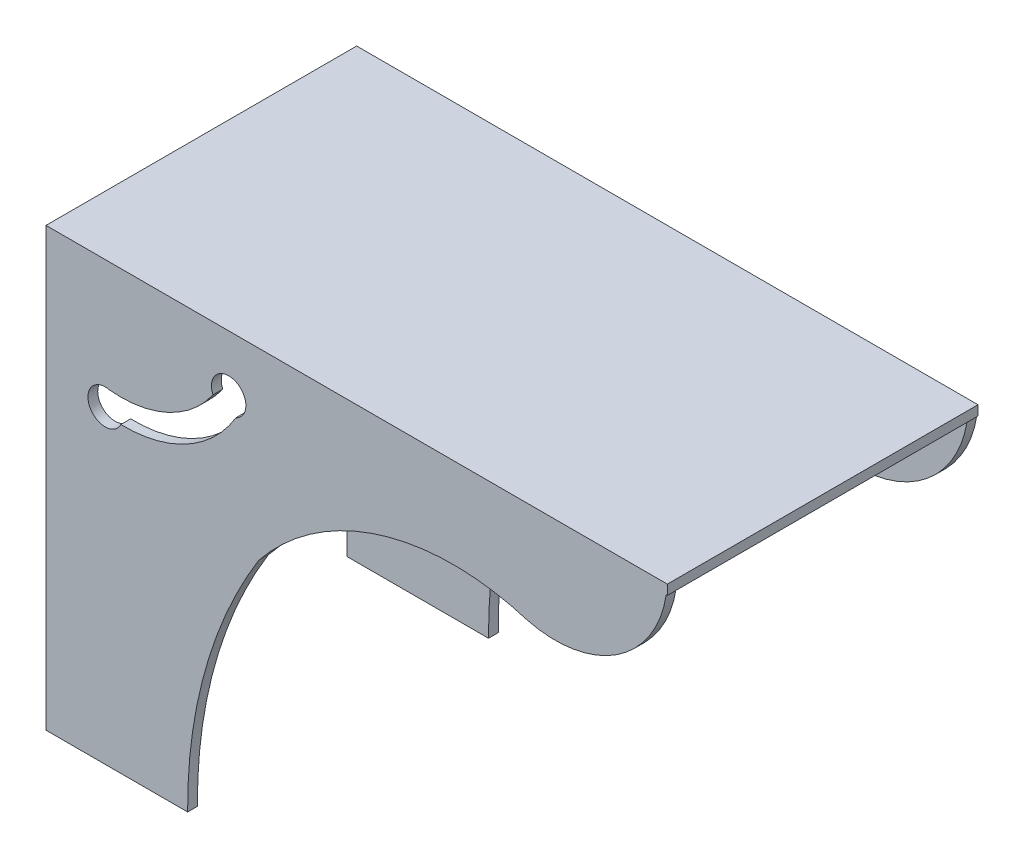
ISO-10303-21;
HEADER;
FILE_DESCRIPTION(('STEP AP214'),'2;1');
FILE_NAME('part.step','',(''),(''),'','','');
FILE_SCHEMA(('AUTOMOTIVE_DESIGN { 1 0 10303 214 1 1 1 1 }'));
ENDSEC;
DATA;
#1=APPLICATION_CONTEXT('core data for automotive mechanical design processes');
#2=APPLICATION_PROTOCOL_DEFINITION('international standard','automotive_design',2000,#1);
#3=PRODUCT_CONTEXT('',#1,'mechanical');
#4=PRODUCT('Part','Part','',(#3));
#5=PRODUCT_RELATED_PRODUCT_CATEGORY('part','',(#4));
#6=PRODUCT_DEFINITION_FORMATION('','',#4);
#7=PRODUCT_DEFINITION_CONTEXT('part definition',#1,'design');
#8=PRODUCT_DEFINITION('design','',#6,#7);
#9=PRODUCT_DEFINITION_SHAPE('','',#8);
#10=(LENGTH_UNIT() NAMED_UNIT(*) SI_UNIT(.MILLI.,.METRE.));
#11=(NAMED_UNIT(*) PLANE_ANGLE_UNIT() SI_UNIT($,.RADIAN.));
#12=(NAMED_UNIT(*) SI_UNIT($,.STERADIAN.) SOLID_ANGLE_UNIT());
#13=UNCERTAINTY_MEASURE_WITH_UNIT(LENGTH_MEASURE(1.E-05),#10,'distance_accuracy_value','');
#14=(GEOMETRIC_REPRESENTATION_CONTEXT(3) GLOBAL_UNCERTAINTY_ASSIGNED_CONTEXT((#13)) GLOBAL_UNIT_ASSIGNED_CONTEXT((#10,
#11,#12)) REPRESENTATION_CONTEXT('',''));
#15=CARTESIAN_POINT('',(0.,0.,0.));
#16=DIRECTION('',(0.,0.,1.));
#17=DIRECTION('',(1.,0.,0.));
#18=AXIS2_PLACEMENT_3D('',#15,#16,#17);
#19=CARTESIAN_POINT('',(0.,0.,0.));
#20=DIRECTION('',(0.,1.,0.));
#21=DIRECTION('',(0.,0.,1.));
#22=AXIS2_PLACEMENT_3D('',#19,#20,#21);
#23=PLANE('',#22);
#24=DIRECTION('',(1.,0.,0.));
#25=VECTOR('',#24,1.);
#26=CARTESIAN_POINT('',(0.,0.,14.875));
#27=LINE('',#26,#25);
#28=CARTESIAN_POINT('',(-31.75,0.,14.875));
#29=VERTEX_POINT('',#28);
#30=CARTESIAN_POINT('',(31.6379040167772,0.,14.875));
#31=VERTEX_POINT('',#30);
#32=EDGE_CURVE('E11',#29,#31,#27,.T.);
#33=ORIENTED_EDGE('',*,*,#32,.F.);
#34=DIRECTION('',(0.,0.,1.));
#35=VECTOR('',#34,1.);
#36=CARTESIAN_POINT('',(-31.75,0.,-15.875));
#37=LINE('',#36,#35);
#38=CARTESIAN_POINT('',(-31.75,0.,-14.875));
#39=VERTEX_POINT('',#38);
#40=EDGE_CURVE('E134',#39,#29,#37,.T.);
#41=ORIENTED_EDGE('',*,*,#40,.F.);
#42=DIRECTION('',(-1.,0.,0.));
#43=VECTOR('',#42,1.);
#44=CARTESIAN_POINT('',(0.,0.,-14.875));
#45=LINE('',#44,#43);
#46=CARTESIAN_POINT('',(31.6379040167772,0.,-14.875));
#47=VERTEX_POINT('',#46);
#48=EDGE_CURVE('E80',#47,#39,#45,.T.);
#49=ORIENTED_EDGE('',*,*,#48,.F.);
#50=DIRECTION('',(0.,0.,-1.));
#51=VECTOR('',#50,1.);
#52=CARTESIAN_POINT('',(31.6379040167772,0.,-14.875));
#53=LINE('',#52,#51);
#54=CARTESIAN_POINT('',(31.6379040167772,0.,-15.875));
#55=VERTEX_POINT('',#54);
#56=EDGE_CURVE('E150',#47,#55,#53,.T.);
#57=ORIENTED_EDGE('',*,*,#56,.T.);
#58=DIRECTION('',(-1.,0.,0.));
#59=VECTOR('',#58,1.);
#60=CARTESIAN_POINT('',(-31.75,0.,-15.875));
#61=LINE('',#60,#59);
#62=CARTESIAN_POINT('',(31.75,0.,-15.875));
#63=VERTEX_POINT('',#62);
#64=EDGE_CURVE('E69',#63,#55,#61,.T.);
#65=ORIENTED_EDGE('',*,*,#64,.F.);
#66=DIRECTION('',(0.,0.,-1.));
#67=VECTOR('',#66,1.);
#68=CARTESIAN_POINT('',(31.75,0.,-15.875));
#69=LINE('',#68,#67);
#70=CARTESIAN_POINT('',(31.75,0.,15.875));
#71=VERTEX_POINT('',#70);
#72=EDGE_CURVE('E127',#71,#63,#69,.T.);
#73=ORIENTED_EDGE('',*,*,#72,.F.);
#74=DIRECTION('',(1.,0.,0.));
#75=VECTOR('',#74,1.);
#76=CARTESIAN_POINT('',(-31.75,0.,15.875));
#77=LINE('',#76,#75);
#78=CARTESIAN_POINT('',(31.6379040167772,0.,15.875));
#79=VERTEX_POINT('',#78);
#80=EDGE_CURVE('E138',#79,#71,#77,.T.);
#81=ORIENTED_EDGE('',*,*,#80,.F.);
#82=DIRECTION('',(0.,0.,1.));
#83=VECTOR('',#82,1.);
#84=CARTESIAN_POINT('',(31.6379040167772,0.,14.875));
#85=LINE('',#84,#83);
#86=EDGE_CURVE('E49',#31,#79,#85,.T.);
#87=ORIENTED_EDGE('',*,*,#86,.F.);
#88=EDGE_LOOP('',(#33,#41,#49,#57,#65,#73,#81,#87));
#89=FACE_BOUND('',#88,.T.);
#90=ADVANCED_FACE('F39',(#89),#23,.F.);
#91=CARTESIAN_POINT('',(31.75,1.,-15.875));
#92=DIRECTION('',(-1.,0.,0.));
#93=DIRECTION('',(0.,0.,1.));
#94=AXIS2_PLACEMENT_3D('',#91,#92,#93);
#95=PLANE('',#94);
#96=ORIENTED_EDGE('',*,*,#72,.T.);
#97=DIRECTION('',(0.,-1.,0.));
#98=VECTOR('',#97,1.);
#99=CARTESIAN_POINT('',(31.75,1.,-15.875));
#100=LINE('',#99,#98);
#101=CARTESIAN_POINT('',(31.75,1.,-15.875));
#102=VERTEX_POINT('',#101);
#103=EDGE_CURVE('E114',#102,#63,#100,.T.);
#104=ORIENTED_EDGE('',*,*,#103,.F.);
#105=DIRECTION('',(0.,0.,-1.));
#106=VECTOR('',#105,1.);
#107=CARTESIAN_POINT('',(31.75,1.,-15.875));
#108=LINE('',#107,#106);
#109=CARTESIAN_POINT('',(31.75,1.,15.875));
#110=VERTEX_POINT('',#109);
#111=EDGE_CURVE('E96',#110,#102,#108,.T.);
#112=ORIENTED_EDGE('',*,*,#111,.F.);
#113=DIRECTION('',(0.,-1.,0.));
#114=VECTOR('',#113,1.);
#115=CARTESIAN_POINT('',(31.75,1.,15.875));
#116=LINE('',#115,#114);
#117=EDGE_CURVE('E123',#110,#71,#116,.T.);
#118=ORIENTED_EDGE('',*,*,#117,.T.);
#119=EDGE_LOOP('',(#96,#104,#112,#118));
#120=FACE_BOUND('',#119,.T.);
#121=ADVANCED_FACE('F41',(#120),#95,.F.);
#122=CARTESIAN_POINT('',(-31.75,1.,-15.875));
#123=DIRECTION('',(0.,0.,1.));
#124=DIRECTION('',(1.,0.,0.));
#125=AXIS2_PLACEMENT_3D('',#122,#123,#124);
#126=PLANE('',#125);
#127=ORIENTED_EDGE('',*,*,#64,.T.);
#128=CARTESIAN_POINT('',(20.2915948472761,1.77815843703277,-15.875));
#129=DIRECTION('',(0.,0.,-1.));
#130=DIRECTION('',(-1.,0.,0.));
#131=AXIS2_PLACEMENT_3D('',#128,#129,#130);
#132=CIRCLE('',#131,11.4847977429772);
#133=CARTESIAN_POINT('',(17.4534216794093,-9.35042423401278,-15.875));
#134=VERTEX_POINT('',#133);
#135=EDGE_CURVE('E256',#55,#134,#132,.T.);
#136=ORIENTED_EDGE('',*,*,#135,.T.);
#137=CARTESIAN_POINT('',(9.89769197929239,-33.6929893961255,-15.875));
#138=DIRECTION('',(0.,0.,1.));
#139=DIRECTION('',(1.,0.,0.));
#140=AXIS2_PLACEMENT_3D('',#137,#138,#139);
#141=CIRCLE('',#140,25.4882233585029);
#142=CARTESIAN_POINT('',(-10.0200966304964,-17.7891776873338,-15.875));
#143=VERTEX_POINT('',#142);
#144=EDGE_CURVE('E291',#134,#143,#141,.T.);
#145=ORIENTED_EDGE('',*,*,#144,.T.);
#146=CARTESIAN_POINT('',(31.1951491813184,-43.2989287250127,-15.875));
#147=DIRECTION('',(0.,0.,1.));
#148=DIRECTION('',(1.,0.,0.));
#149=AXIS2_PLACEMENT_3D('',#146,#147,#148);
#150=CIRCLE('',#149,48.4710623499493);
#151=CARTESIAN_POINT('',(-17.2743956937058,-43.6824713441464,-15.875));
#152=VERTEX_POINT('',#151);
#153=EDGE_CURVE('E295',#143,#152,#150,.T.);
#154=ORIENTED_EDGE('',*,*,#153,.T.);
#155=DIRECTION('',(-1.,0.,0.));
#156=VECTOR('',#155,1.);
#157=CARTESIAN_POINT('',(-17.2743956937058,-43.6824713441464,-15.875));
#158=LINE('',#157,#156);
#159=CARTESIAN_POINT('',(-31.75,-43.6824713441464,-15.875));
#160=VERTEX_POINT('',#159);
#161=EDGE_CURVE('E109',#152,#160,#158,.T.);
#162=ORIENTED_EDGE('',*,*,#161,.T.);
#163=DIRECTION('',(0.,-1.,0.));
#164=VECTOR('',#163,1.);
#165=CARTESIAN_POINT('',(-31.75,1.,-15.875));
#166=LINE('',#165,#164);
#167=CARTESIAN_POINT('',(-31.75,1.,-15.875));
#168=VERTEX_POINT('',#167);
#169=EDGE_CURVE('E103',#168,#160,#166,.T.);
#170=ORIENTED_EDGE('',*,*,#169,.F.);
#171=DIRECTION('',(-1.,0.,0.));
#172=VECTOR('',#171,1.);
#173=CARTESIAN_POINT('',(-31.75,1.,-15.875));
#174=LINE('',#173,#172);
#175=EDGE_CURVE('E89',#102,#168,#174,.T.);
#176=ORIENTED_EDGE('',*,*,#175,.F.);
#177=ORIENTED_EDGE('',*,*,#103,.T.);
#178=EDGE_LOOP('',(#127,#136,#145,#154,#162,#170,#176,#177));
#179=FACE_BOUND('',#178,.T.);
#180=CARTESIAN_POINT('',(-13.0812509604539,-4.7342310141083,-15.875));
#181=DIRECTION('',(0.,0.,-1.));
#182=DIRECTION('',(-1.,0.,0.));
#183=AXIS2_PLACEMENT_3D('',#180,#181,#182);
#184=CIRCLE('',#183,1.75850942259397);
#185=CARTESIAN_POINT('',(-14.6821723220576,-5.46183405376155,-15.875));
#186=VERTEX_POINT('',#185);
#187=CARTESIAN_POINT('',(-12.3536479208006,-6.33515237571203,-15.875));
#188=VERTEX_POINT('',#187);
#189=EDGE_CURVE('E236',#186,#188,#184,.T.);
#190=ORIENTED_EDGE('',*,*,#189,.F.);
#191=CARTESIAN_POINT('',(-24.0968511259508,1.0851600643245,-15.875));
#192=DIRECTION('',(0.,0.,1.));
#193=DIRECTION('',(-1.,0.,0.));
#194=AXIS2_PLACEMENT_3D('',#191,#192,#193);
#195=CIRCLE('',#194,11.4673148104833);
#196=CARTESIAN_POINT('',(-25.2846256929615,-10.3204745318166,-15.875));
#197=VERTEX_POINT('',#196);
#198=EDGE_CURVE('E223',#197,#186,#195,.T.);
#199=ORIENTED_EDGE('',*,*,#198,.F.);
#200=CARTESIAN_POINT('',(-25.6949217020572,-12.0405759818048,-15.875));
#201=DIRECTION('',(0.,0.,-1.));
#202=DIRECTION('',(1.,0.,0.));
#203=AXIS2_PLACEMENT_3D('',#200,#201,#202);
#204=CIRCLE('',#203,1.76835850814573);
#205=CARTESIAN_POINT('',(-24.0968511259508,-12.7977168188451,-15.875));
#206=VERTEX_POINT('',#205);
#207=EDGE_CURVE('E245',#206,#197,#204,.T.);
#208=ORIENTED_EDGE('',*,*,#207,.F.);
#209=CARTESIAN_POINT('',(-23.7461456214285,0.465651786454748,-15.875));
#210=DIRECTION('',(0.,0.,-1.));
#211=DIRECTION('',(-1.,0.,0.));
#212=AXIS2_PLACEMENT_3D('',#209,#210,#211);
#213=CIRCLE('',#212,13.2680044132852);
#214=EDGE_CURVE('E240',#188,#206,#213,.T.);
#215=ORIENTED_EDGE('',*,*,#214,.F.);
#216=EDGE_LOOP('',(#190,#199,#208,#215));
#217=FACE_BOUND('',#216,.T.);
#218=ADVANCED_FACE('F104',(#179,#217),#126,.F.);
#219=CARTESIAN_POINT('',(-31.75,1.,-15.875));
#220=DIRECTION('',(1.,0.,0.));
#221=DIRECTION('',(0.,0.,-1.));
#222=AXIS2_PLACEMENT_3D('',#219,#220,#221);
#223=PLANE('',#222);
#224=DIRECTION('',(0.,-1.,0.));
#225=VECTOR('',#224,1.);
#226=CARTESIAN_POINT('',(-31.75,1.,15.875));
#227=LINE('',#226,#225);
#228=CARTESIAN_POINT('',(-31.75,1.,15.875));
#229=VERTEX_POINT('',#228);
#230=CARTESIAN_POINT('',(-31.75,-43.6824713441464,15.875));
#231=VERTEX_POINT('',#230);
#232=EDGE_CURVE('E115',#229,#231,#227,.T.);
#233=ORIENTED_EDGE('',*,*,#232,.F.);
#234=DIRECTION('',(0.,0.,1.));
#235=VECTOR('',#234,1.);
#236=CARTESIAN_POINT('',(-31.75,1.,-15.875));
#237=LINE('',#236,#235);
#238=EDGE_CURVE('E93',#168,#229,#237,.T.);
#239=ORIENTED_EDGE('',*,*,#238,.F.);
#240=ORIENTED_EDGE('',*,*,#169,.T.);
#241=DIRECTION('',(0.,0.,-1.));
#242=VECTOR('',#241,1.);
#243=CARTESIAN_POINT('',(-31.75,-43.6824713441464,-14.875));
#244=LINE('',#243,#242);
#245=CARTESIAN_POINT('',(-31.75,-43.6824713441464,-14.875));
#246=VERTEX_POINT('',#245);
#247=EDGE_CURVE('E131',#246,#160,#244,.T.);
#248=ORIENTED_EDGE('',*,*,#247,.F.);
#249=DIRECTION('',(0.,1.,0.));
#250=VECTOR('',#249,1.);
#251=CARTESIAN_POINT('',(-31.75,-17.7891776873338,-14.875));
#252=LINE('',#251,#250);
#253=EDGE_CURVE('E284',#246,#39,#252,.T.);
#254=ORIENTED_EDGE('',*,*,#253,.T.);
#255=ORIENTED_EDGE('',*,*,#40,.T.);
#256=DIRECTION('',(0.,1.,0.));
#257=VECTOR('',#256,1.);
#258=CARTESIAN_POINT('',(-31.75,1.,14.875));
#259=LINE('',#258,#257);
#260=CARTESIAN_POINT('',(-31.75,-43.6824713441464,14.875));
#261=VERTEX_POINT('',#260);
#262=EDGE_CURVE('E204',#261,#29,#259,.T.);
#263=ORIENTED_EDGE('',*,*,#262,.F.);
#264=DIRECTION('',(0.,0.,1.));
#265=VECTOR('',#264,1.);
#266=CARTESIAN_POINT('',(-31.75,-43.6824713441464,14.875));
#267=LINE('',#266,#265);
#268=EDGE_CURVE('E196',#261,#231,#267,.T.);
#269=ORIENTED_EDGE('',*,*,#268,.T.);
#270=EDGE_LOOP('',(#233,#239,#240,#248,#254,#255,#263,#269));
#271=FACE_BOUND('',#270,.T.);
#272=ADVANCED_FACE('F117',(#271),#223,.F.);
#273=CARTESIAN_POINT('',(-31.75,1.,15.875));
#274=DIRECTION('',(0.,0.,-1.));
#275=DIRECTION('',(-1.,0.,0.));
#276=AXIS2_PLACEMENT_3D('',#273,#274,#275);
#277=PLANE('',#276);
#278=ORIENTED_EDGE('',*,*,#232,.T.);
#279=DIRECTION('',(-1.,0.,0.));
#280=VECTOR('',#279,1.);
#281=CARTESIAN_POINT('',(-17.2743956937058,-43.6824713441464,15.875));
#282=LINE('',#281,#280);
#283=CARTESIAN_POINT('',(-17.2743956937058,-43.6824713441464,15.875));
#284=VERTEX_POINT('',#283);
#285=EDGE_CURVE('E180',#284,#231,#282,.T.);
#286=ORIENTED_EDGE('',*,*,#285,.F.);
#287=CARTESIAN_POINT('',(31.1951491813184,-43.2989287250127,15.875));
#288=DIRECTION('',(0.,0.,1.));
#289=DIRECTION('',(1.,0.,0.));
#290=AXIS2_PLACEMENT_3D('',#287,#288,#289);
#291=CIRCLE('',#290,48.4710623499493);
#292=CARTESIAN_POINT('',(-10.0200966304964,-17.7891776873338,15.875));
#293=VERTEX_POINT('',#292);
#294=EDGE_CURVE('E200',#293,#284,#291,.T.);
#295=ORIENTED_EDGE('',*,*,#294,.F.);
#296=CARTESIAN_POINT('',(9.89769197929239,-33.6929893961255,15.875));
#297=DIRECTION('',(0.,0.,1.));
#298=DIRECTION('',(1.,0.,0.));
#299=AXIS2_PLACEMENT_3D('',#296,#297,#298);
#300=CIRCLE('',#299,25.4882233585029);
#301=CARTESIAN_POINT('',(17.4534216794093,-9.35042423401278,15.875));
#302=VERTEX_POINT('',#301);
#303=EDGE_CURVE('E177',#302,#293,#300,.T.);
#304=ORIENTED_EDGE('',*,*,#303,.F.);
#305=CARTESIAN_POINT('',(20.2915948472761,1.77815843703277,15.875));
#306=DIRECTION('',(0.,0.,-1.));
#307=DIRECTION('',(-1.,0.,0.));
#308=AXIS2_PLACEMENT_3D('',#305,#306,#307);
#309=CIRCLE('',#308,11.4847977429772);
#310=EDGE_CURVE('E163',#79,#302,#309,.T.);
#311=ORIENTED_EDGE('',*,*,#310,.F.);
#312=ORIENTED_EDGE('',*,*,#80,.T.);
#313=ORIENTED_EDGE('',*,*,#117,.F.);
#314=DIRECTION('',(1.,0.,0.));
#315=VECTOR('',#314,1.);
#316=CARTESIAN_POINT('',(-31.75,1.,15.875));
#317=LINE('',#316,#315);
#318=EDGE_CURVE('E57',#229,#110,#317,.T.);
#319=ORIENTED_EDGE('',*,*,#318,.F.);
#320=EDGE_LOOP('',(#278,#286,#295,#304,#311,#312,#313,#319));
#321=FACE_BOUND('',#320,.T.);
#322=CARTESIAN_POINT('',(-24.0968511259508,1.0851600643245,15.875));
#323=DIRECTION('',(0.,0.,1.));
#324=DIRECTION('',(-1.,0.,0.));
#325=AXIS2_PLACEMENT_3D('',#322,#323,#324);
#326=CIRCLE('',#325,11.4673148104833);
#327=CARTESIAN_POINT('',(-25.2846256929615,-10.3204745318166,15.875));
#328=VERTEX_POINT('',#327);
#329=CARTESIAN_POINT('',(-14.6821723220576,-5.46183405376155,15.875));
#330=VERTEX_POINT('',#329);
#331=EDGE_CURVE('E362',#328,#330,#326,.T.);
#332=ORIENTED_EDGE('',*,*,#331,.T.);
#333=CARTESIAN_POINT('',(-13.0812509604539,-4.7342310141083,15.875));
#334=DIRECTION('',(0.,0.,-1.));
#335=DIRECTION('',(-1.,0.,0.));
#336=AXIS2_PLACEMENT_3D('',#333,#334,#335);
#337=CIRCLE('',#336,1.75850942259397);
#338=CARTESIAN_POINT('',(-12.3536479208006,-6.33515237571202,15.875));
#339=VERTEX_POINT('',#338);
#340=EDGE_CURVE('E366',#330,#339,#337,.T.);
#341=ORIENTED_EDGE('',*,*,#340,.T.);
#342=CARTESIAN_POINT('',(-23.7461456214285,0.465651786454748,15.875));
#343=DIRECTION('',(0.,0.,-1.));
#344=DIRECTION('',(-1.,0.,0.));
#345=AXIS2_PLACEMENT_3D('',#342,#343,#344);
#346=CIRCLE('',#345,13.2680044132852);
#347=CARTESIAN_POINT('',(-24.0968511259508,-12.7977168188451,15.875));
#348=VERTEX_POINT('',#347);
#349=EDGE_CURVE('E353',#339,#348,#346,.T.);
#350=ORIENTED_EDGE('',*,*,#349,.T.);
#351=CARTESIAN_POINT('',(-25.6949217020572,-12.0405759818048,15.875));
#352=DIRECTION('',(0.,0.,-1.));
#353=DIRECTION('',(1.,0.,0.));
#354=AXIS2_PLACEMENT_3D('',#351,#352,#353);
#355=CIRCLE('',#354,1.76835850814573);
#356=EDGE_CURVE('E358',#348,#328,#355,.T.);
#357=ORIENTED_EDGE('',*,*,#356,.T.);
#358=EDGE_LOOP('',(#332,#341,#350,#357));
#359=FACE_BOUND('',#358,.T.);
#360=ADVANCED_FACE('F173',(#321,#359),#277,.F.);
#361=CARTESIAN_POINT('',(0.,1.,0.));
#362=DIRECTION('',(0.,1.,0.));
#363=DIRECTION('',(0.,0.,1.));
#364=AXIS2_PLACEMENT_3D('',#361,#362,#363);
#365=PLANE('',#364);
#366=ORIENTED_EDGE('',*,*,#111,.T.);
#367=ORIENTED_EDGE('',*,*,#175,.T.);
#368=ORIENTED_EDGE('',*,*,#238,.T.);
#369=ORIENTED_EDGE('',*,*,#318,.T.);
#370=EDGE_LOOP('',(#366,#367,#368,#369));
#371=FACE_BOUND('',#370,.T.);
#372=ADVANCED_FACE('F91',(#371),#365,.T.);
#373=CARTESIAN_POINT('',(20.2915948472761,1.77815843703277,-14.875));
#374=DIRECTION('',(0.,0.,-1.));
#375=DIRECTION('',(-1.,0.,0.));
#376=AXIS2_PLACEMENT_3D('',#373,#374,#375);
#377=CYLINDRICAL_SURFACE('',#376,11.4847977429772);
#378=ORIENTED_EDGE('',*,*,#56,.F.);
#379=CARTESIAN_POINT('',(20.2915948472761,1.77815843703277,-14.875));
#380=DIRECTION('',(0.,0.,-1.));
#381=DIRECTION('',(-1.,0.,0.));
#382=AXIS2_PLACEMENT_3D('',#379,#380,#381);
#383=CIRCLE('',#382,11.4847977429772);
#384=CARTESIAN_POINT('',(17.4534216794093,-9.35042423401278,-14.875));
#385=VERTEX_POINT('',#384);
#386=EDGE_CURVE('E268',#47,#385,#383,.T.);
#387=ORIENTED_EDGE('',*,*,#386,.T.);
#388=DIRECTION('',(0.,0.,-1.));
#389=VECTOR('',#388,1.);
#390=CARTESIAN_POINT('',(17.4534216794093,-9.35042423401278,-14.875));
#391=LINE('',#390,#389);
#392=EDGE_CURVE('E287',#385,#134,#391,.T.);
#393=ORIENTED_EDGE('',*,*,#392,.T.);
#394=ORIENTED_EDGE('',*,*,#135,.F.);
#395=EDGE_LOOP('',(#378,#387,#393,#394));
#396=FACE_BOUND('',#395,.T.);
#397=ADVANCED_FACE('F458',(#396),#377,.T.);
#398=CARTESIAN_POINT('',(20.2915948472761,1.77815843703277,-14.875));
#399=DIRECTION('',(0.,0.,-1.));
#400=DIRECTION('',(-1.,0.,0.));
#401=AXIS2_PLACEMENT_3D('',#398,#399,#400);
#402=PLANE('',#401);
#403=CARTESIAN_POINT('',(-24.0968511259508,1.0851600643245,-14.875));
#404=DIRECTION('',(0.,0.,1.));
#405=DIRECTION('',(-1.,0.,0.));
#406=AXIS2_PLACEMENT_3D('',#403,#404,#405);
#407=CIRCLE('',#406,11.4673148104833);
#408=CARTESIAN_POINT('',(-25.2846256929615,-10.3204745318166,-14.875));
#409=VERTEX_POINT('',#408);
#410=CARTESIAN_POINT('',(-14.6821723220576,-5.46183405376155,-14.875));
#411=VERTEX_POINT('',#410);
#412=EDGE_CURVE('E231',#409,#411,#407,.T.);
#413=ORIENTED_EDGE('',*,*,#412,.T.);
#414=CARTESIAN_POINT('',(-13.0812509604539,-4.7342310141083,-14.875));
#415=DIRECTION('',(0.,0.,-1.));
#416=DIRECTION('',(-1.,0.,0.));
#417=AXIS2_PLACEMENT_3D('',#414,#415,#416);
#418=CIRCLE('',#417,1.75850942259397);
#419=CARTESIAN_POINT('',(-12.3536479208006,-6.33515237571202,-14.875));
#420=VERTEX_POINT('',#419);
#421=EDGE_CURVE('E218',#411,#420,#418,.T.);
#422=ORIENTED_EDGE('',*,*,#421,.T.);
#423=CARTESIAN_POINT('',(-23.7461456214285,0.465651786454748,-14.875));
#424=DIRECTION('',(0.,0.,-1.));
#425=DIRECTION('',(-1.,0.,0.));
#426=AXIS2_PLACEMENT_3D('',#423,#424,#425);
#427=CIRCLE('',#426,13.2680044132852);
#428=CARTESIAN_POINT('',(-24.0968511259508,-12.7977168188451,-14.875));
#429=VERTEX_POINT('',#428);
#430=EDGE_CURVE('E222',#420,#429,#427,.T.);
#431=ORIENTED_EDGE('',*,*,#430,.T.);
#432=CARTESIAN_POINT('',(-25.6949217020572,-12.0405759818048,-14.875));
#433=DIRECTION('',(0.,0.,-1.));
#434=DIRECTION('',(1.,0.,0.));
#435=AXIS2_PLACEMENT_3D('',#432,#433,#434);
#436=CIRCLE('',#435,1.76835850814573);
#437=EDGE_CURVE('E227',#429,#409,#436,.T.);
#438=ORIENTED_EDGE('',*,*,#437,.T.);
#439=EDGE_LOOP('',(#413,#422,#431,#438));
#440=FACE_BOUND('',#439,.T.);
#441=ORIENTED_EDGE('',*,*,#386,.F.);
#442=ORIENTED_EDGE('',*,*,#48,.T.);
#443=ORIENTED_EDGE('',*,*,#253,.F.);
#444=DIRECTION('',(-1.,0.,0.));
#445=VECTOR('',#444,1.);
#446=CARTESIAN_POINT('',(-17.2743956937058,-43.6824713441464,-14.875));
#447=LINE('',#446,#445);
#448=CARTESIAN_POINT('',(-17.2743956937058,-43.6824713441464,-14.875));
#449=VERTEX_POINT('',#448);
#450=EDGE_CURVE('E280',#449,#246,#447,.T.);
#451=ORIENTED_EDGE('',*,*,#450,.F.);
#452=CARTESIAN_POINT('',(31.1951491813184,-43.2989287250127,-14.875));
#453=DIRECTION('',(0.,0.,1.));
#454=DIRECTION('',(1.,0.,0.));
#455=AXIS2_PLACEMENT_3D('',#452,#453,#454);
#456=CIRCLE('',#455,48.4710623499493);
#457=CARTESIAN_POINT('',(-10.0200966304964,-17.7891776873338,-14.875));
#458=VERTEX_POINT('',#457);
#459=EDGE_CURVE('E276',#458,#449,#456,.T.);
#460=ORIENTED_EDGE('',*,*,#459,.F.);
#461=CARTESIAN_POINT('',(9.89769197929239,-33.6929893961255,-14.875));
#462=DIRECTION('',(0.,0.,1.));
#463=DIRECTION('',(1.,0.,0.));
#464=AXIS2_PLACEMENT_3D('',#461,#462,#463);
#465=CIRCLE('',#464,25.4882233585029);
#466=EDGE_CURVE('E272',#385,#458,#465,.T.);
#467=ORIENTED_EDGE('',*,*,#466,.F.);
#468=EDGE_LOOP('',(#441,#442,#443,#451,#460,#467));
#469=FACE_BOUND('',#468,.T.);
#470=ADVANCED_FACE('F463',(#440,#469),#402,.F.);
#471=CARTESIAN_POINT('',(-17.2743956937058,-43.6824713441464,-14.875));
#472=DIRECTION('',(0.,-1.,0.));
#473=DIRECTION('',(0.,0.,-1.));
#474=AXIS2_PLACEMENT_3D('',#471,#472,#473);
#475=PLANE('',#474);
#476=ORIENTED_EDGE('',*,*,#161,.F.);
#477=DIRECTION('',(0.,0.,-1.));
#478=VECTOR('',#477,1.);
#479=CARTESIAN_POINT('',(-17.2743956937058,-43.6824713441464,-14.875));
#480=LINE('',#479,#478);
#481=EDGE_CURVE('E302',#449,#152,#480,.T.);
#482=ORIENTED_EDGE('',*,*,#481,.F.);
#483=ORIENTED_EDGE('',*,*,#450,.T.);
#484=ORIENTED_EDGE('',*,*,#247,.T.);
#485=EDGE_LOOP('',(#476,#482,#483,#484));
#486=FACE_BOUND('',#485,.T.);
#487=ADVANCED_FACE('F466',(#486),#475,.T.);
#488=CARTESIAN_POINT('',(31.1951491813184,-43.2989287250127,-14.875));
#489=DIRECTION('',(0.,0.,-1.));
#490=DIRECTION('',(-1.,0.,0.));
#491=AXIS2_PLACEMENT_3D('',#488,#489,#490);
#492=CYLINDRICAL_SURFACE('',#491,48.4710623499493);
#493=ORIENTED_EDGE('',*,*,#153,.F.);
#494=DIRECTION('',(0.,0.,-1.));
#495=VECTOR('',#494,1.);
#496=CARTESIAN_POINT('',(-10.0200966304964,-17.7891776873338,-14.875));
#497=LINE('',#496,#495);
#498=EDGE_CURVE('E306',#458,#143,#497,.T.);
#499=ORIENTED_EDGE('',*,*,#498,.F.);
#500=ORIENTED_EDGE('',*,*,#459,.T.);
#501=ORIENTED_EDGE('',*,*,#481,.T.);
#502=EDGE_LOOP('',(#493,#499,#500,#501));
#503=FACE_BOUND('',#502,.T.);
#504=ADVANCED_FACE('F469',(#503),#492,.F.);
#505=CARTESIAN_POINT('',(9.89769197929239,-33.6929893961255,-14.875));
#506=DIRECTION('',(0.,0.,-1.));
#507=DIRECTION('',(-1.,0.,0.));
#508=AXIS2_PLACEMENT_3D('',#505,#506,#507);
#509=CYLINDRICAL_SURFACE('',#508,25.4882233585029);
#510=ORIENTED_EDGE('',*,*,#144,.F.);
#511=ORIENTED_EDGE('',*,*,#392,.F.);
#512=ORIENTED_EDGE('',*,*,#466,.T.);
#513=ORIENTED_EDGE('',*,*,#498,.T.);
#514=EDGE_LOOP('',(#510,#511,#512,#513));
#515=FACE_BOUND('',#514,.T.);
#516=ADVANCED_FACE('F472',(#515),#509,.F.);
#517=CARTESIAN_POINT('',(-13.0812509604539,-4.7342310141083,-14.875));
#518=DIRECTION('',(0.,0.,-1.));
#519=DIRECTION('',(-1.,0.,0.));
#520=AXIS2_PLACEMENT_3D('',#517,#518,#519);
#521=CYLINDRICAL_SURFACE('',#520,1.75850942259397);
#522=ORIENTED_EDGE('',*,*,#189,.T.);
#523=DIRECTION('',(0.,0.,-1.));
#524=VECTOR('',#523,1.);
#525=CARTESIAN_POINT('',(-12.3536479208006,-6.33515237571202,-14.875));
#526=LINE('',#525,#524);
#527=EDGE_CURVE('E235',#420,#188,#526,.T.);
#528=ORIENTED_EDGE('',*,*,#527,.F.);
#529=ORIENTED_EDGE('',*,*,#421,.F.);
#530=DIRECTION('',(0.,0.,-1.));
#531=VECTOR('',#530,1.);
#532=CARTESIAN_POINT('',(-14.6821723220576,-5.46183405376155,-14.875));
#533=LINE('',#532,#531);
#534=EDGE_CURVE('E252',#411,#186,#533,.T.);
#535=ORIENTED_EDGE('',*,*,#534,.T.);
#536=EDGE_LOOP('',(#522,#528,#529,#535));
#537=FACE_BOUND('',#536,.T.);
#538=ADVANCED_FACE('F474',(#537),#521,.F.);
#539=CARTESIAN_POINT('',(-24.0968511259508,1.0851600643245,-14.875));
#540=DIRECTION('',(0.,0.,-1.));
#541=DIRECTION('',(-1.,0.,0.));
#542=AXIS2_PLACEMENT_3D('',#539,#540,#541);
#543=CYLINDRICAL_SURFACE('',#542,11.4673148104833);
#544=ORIENTED_EDGE('',*,*,#198,.T.);
#545=ORIENTED_EDGE('',*,*,#534,.F.);
#546=ORIENTED_EDGE('',*,*,#412,.F.);
#547=DIRECTION('',(0.,0.,-1.));
#548=VECTOR('',#547,1.);
#549=CARTESIAN_POINT('',(-25.2846256929615,-10.3204745318166,-14.875));
#550=LINE('',#549,#548);
#551=EDGE_CURVE('E257',#409,#197,#550,.T.);
#552=ORIENTED_EDGE('',*,*,#551,.T.);
#553=EDGE_LOOP('',(#544,#545,#546,#552));
#554=FACE_BOUND('',#553,.T.);
#555=ADVANCED_FACE('F480',(#554),#543,.T.);
#556=CARTESIAN_POINT('',(-25.6949217020572,-12.0405759818048,-14.875));
#557=DIRECTION('',(0.,0.,-1.));
#558=DIRECTION('',(-1.,0.,0.));
#559=AXIS2_PLACEMENT_3D('',#556,#557,#558);
#560=CYLINDRICAL_SURFACE('',#559,1.76835850814573);
#561=ORIENTED_EDGE('',*,*,#207,.T.);
#562=ORIENTED_EDGE('',*,*,#551,.F.);
#563=ORIENTED_EDGE('',*,*,#437,.F.);
#564=DIRECTION('',(0.,0.,-1.));
#565=VECTOR('',#564,1.);
#566=CARTESIAN_POINT('',(-24.0968511259508,-12.7977168188451,-14.875));
#567=LINE('',#566,#565);
#568=EDGE_CURVE('E261',#429,#206,#567,.T.);
#569=ORIENTED_EDGE('',*,*,#568,.T.);
#570=EDGE_LOOP('',(#561,#562,#563,#569));
#571=FACE_BOUND('',#570,.T.);
#572=ADVANCED_FACE('F555',(#571),#560,.F.);
#573=CARTESIAN_POINT('',(-23.7461456214285,0.465651786454748,-14.875));
#574=DIRECTION('',(0.,0.,-1.));
#575=DIRECTION('',(-1.,0.,0.));
#576=AXIS2_PLACEMENT_3D('',#573,#574,#575);
#577=CYLINDRICAL_SURFACE('',#576,13.2680044132852);
#578=ORIENTED_EDGE('',*,*,#214,.T.);
#579=ORIENTED_EDGE('',*,*,#568,.F.);
#580=ORIENTED_EDGE('',*,*,#430,.F.);
#581=ORIENTED_EDGE('',*,*,#527,.T.);
#582=EDGE_LOOP('',(#578,#579,#580,#581));
#583=FACE_BOUND('',#582,.T.);
#584=ADVANCED_FACE('F565',(#583),#577,.F.);
#585=CARTESIAN_POINT('',(20.2915948472761,1.77815843703277,14.875));
#586=DIRECTION('',(0.,0.,1.));
#587=DIRECTION('',(-1.,0.,0.));
#588=AXIS2_PLACEMENT_3D('',#585,#586,#587);
#589=PLANE('',#588);
#590=CARTESIAN_POINT('',(-13.0812509604539,-4.7342310141083,14.875));
#591=DIRECTION('',(0.,0.,-1.));
#592=DIRECTION('',(-1.,0.,0.));
#593=AXIS2_PLACEMENT_3D('',#590,#591,#592);
#594=CIRCLE('',#593,1.75850942259397);
#595=CARTESIAN_POINT('',(-14.6821723220576,-5.46183405376155,14.875));
#596=VERTEX_POINT('',#595);
#597=CARTESIAN_POINT('',(-12.3536479208006,-6.33515237571202,14.875));
#598=VERTEX_POINT('',#597);
#599=EDGE_CURVE('E357',#596,#598,#594,.T.);
#600=ORIENTED_EDGE('',*,*,#599,.F.);
#601=CARTESIAN_POINT('',(-24.0968511259508,1.0851600643245,14.875));
#602=DIRECTION('',(0.,0.,1.));
#603=DIRECTION('',(-1.,0.,0.));
#604=AXIS2_PLACEMENT_3D('',#601,#602,#603);
#605=CIRCLE('',#604,11.4673148104833);
#606=CARTESIAN_POINT('',(-25.2846256929615,-10.3204745318166,14.875));
#607=VERTEX_POINT('',#606);
#608=EDGE_CURVE('E377',#607,#596,#605,.T.);
#609=ORIENTED_EDGE('',*,*,#608,.F.);
#610=CARTESIAN_POINT('',(-25.6949217020572,-12.0405759818048,14.875));
#611=DIRECTION('',(0.,0.,-1.));
#612=DIRECTION('',(1.,0.,0.));
#613=AXIS2_PLACEMENT_3D('',#610,#611,#612);
#614=CIRCLE('',#613,1.76835850814573);
#615=CARTESIAN_POINT('',(-24.0968511259508,-12.7977168188451,14.875));
#616=VERTEX_POINT('',#615);
#617=EDGE_CURVE('E373',#616,#607,#614,.T.);
#618=ORIENTED_EDGE('',*,*,#617,.F.);
#619=CARTESIAN_POINT('',(-23.7461456214285,0.465651786454748,14.875));
#620=DIRECTION('',(0.,0.,-1.));
#621=DIRECTION('',(-1.,0.,0.));
#622=AXIS2_PLACEMENT_3D('',#619,#620,#621);
#623=CIRCLE('',#622,13.2680044132852);
#624=EDGE_CURVE('E342',#598,#616,#623,.T.);
#625=ORIENTED_EDGE('',*,*,#624,.F.);
#626=EDGE_LOOP('',(#600,#609,#618,#625));
#627=FACE_BOUND('',#626,.T.);
#628=ORIENTED_EDGE('',*,*,#262,.T.);
#629=ORIENTED_EDGE('',*,*,#32,.T.);
#630=CARTESIAN_POINT('',(20.2915948472761,1.77815843703277,14.875));
#631=DIRECTION('',(0.,0.,-1.));
#632=DIRECTION('',(-1.,0.,0.));
#633=AXIS2_PLACEMENT_3D('',#630,#631,#632);
#634=CIRCLE('',#633,11.4847977429772);
#635=CARTESIAN_POINT('',(17.4534216794093,-9.35042423401278,14.875));
#636=VERTEX_POINT('',#635);
#637=EDGE_CURVE('E167',#31,#636,#634,.T.);
#638=ORIENTED_EDGE('',*,*,#637,.T.);
#639=CARTESIAN_POINT('',(9.89769197929239,-33.6929893961255,14.875));
#640=DIRECTION('',(0.,0.,1.));
#641=DIRECTION('',(1.,0.,0.));
#642=AXIS2_PLACEMENT_3D('',#639,#640,#641);
#643=CIRCLE('',#642,25.4882233585029);
#644=CARTESIAN_POINT('',(-10.0200966304964,-17.7891776873338,14.875));
#645=VERTEX_POINT('',#644);
#646=EDGE_CURVE('E207',#636,#645,#643,.T.);
#647=ORIENTED_EDGE('',*,*,#646,.T.);
#648=CARTESIAN_POINT('',(31.1951491813184,-43.2989287250127,14.875));
#649=DIRECTION('',(0.,0.,1.));
#650=DIRECTION('',(1.,0.,0.));
#651=AXIS2_PLACEMENT_3D('',#648,#649,#650);
#652=CIRCLE('',#651,48.4710623499493);
#653=CARTESIAN_POINT('',(-17.2743956937058,-43.6824713441464,14.875));
#654=VERTEX_POINT('',#653);
#655=EDGE_CURVE('E214',#645,#654,#652,.T.);
#656=ORIENTED_EDGE('',*,*,#655,.T.);
#657=DIRECTION('',(-1.,0.,0.));
#658=VECTOR('',#657,1.);
#659=CARTESIAN_POINT('',(-17.2743956937058,-43.6824713441464,14.875));
#660=LINE('',#659,#658);
#661=EDGE_CURVE('E330',#654,#261,#660,.T.);
#662=ORIENTED_EDGE('',*,*,#661,.T.);
#663=EDGE_LOOP('',(#628,#629,#638,#647,#656,#662));
#664=FACE_BOUND('',#663,.T.);
#665=ADVANCED_FACE('F401',(#627,#664),#589,.F.);
#666=CARTESIAN_POINT('',(20.2915948472761,1.77815843703277,14.875));
#667=DIRECTION('',(0.,0.,1.));
#668=DIRECTION('',(1.,0.,0.));
#669=AXIS2_PLACEMENT_3D('',#666,#667,#668);
#670=CYLINDRICAL_SURFACE('',#669,11.4847977429772);
#671=ORIENTED_EDGE('',*,*,#637,.F.);
#672=ORIENTED_EDGE('',*,*,#86,.T.);
#673=ORIENTED_EDGE('',*,*,#310,.T.);
#674=DIRECTION('',(0.,0.,1.));
#675=VECTOR('',#674,1.);
#676=CARTESIAN_POINT('',(17.4534216794093,-9.35042423401278,14.875));
#677=LINE('',#676,#675);
#678=EDGE_CURVE('E241',#636,#302,#677,.T.);
#679=ORIENTED_EDGE('',*,*,#678,.F.);
#680=EDGE_LOOP('',(#671,#672,#673,#679));
#681=FACE_BOUND('',#680,.T.);
#682=ADVANCED_FACE('F160',(#681),#670,.T.);
#683=CARTESIAN_POINT('',(9.89769197929239,-33.6929893961255,14.875));
#684=DIRECTION('',(0.,0.,1.));
#685=DIRECTION('',(1.,0.,0.));
#686=AXIS2_PLACEMENT_3D('',#683,#684,#685);
#687=CYLINDRICAL_SURFACE('',#686,25.4882233585029);
#688=ORIENTED_EDGE('',*,*,#303,.T.);
#689=DIRECTION('',(0.,0.,1.));
#690=VECTOR('',#689,1.);
#691=CARTESIAN_POINT('',(-10.0200966304964,-17.7891776873338,14.875));
#692=LINE('',#691,#690);
#693=EDGE_CURVE('E211',#645,#293,#692,.T.);
#694=ORIENTED_EDGE('',*,*,#693,.F.);
#695=ORIENTED_EDGE('',*,*,#646,.F.);
#696=ORIENTED_EDGE('',*,*,#678,.T.);
#697=EDGE_LOOP('',(#688,#694,#695,#696));
#698=FACE_BOUND('',#697,.T.);
#699=ADVANCED_FACE('F621',(#698),#687,.F.);
#700=CARTESIAN_POINT('',(31.1951491813184,-43.2989287250127,14.875));
#701=DIRECTION('',(0.,0.,1.));
#702=DIRECTION('',(1.,0.,0.));
#703=AXIS2_PLACEMENT_3D('',#700,#701,#702);
#704=CYLINDRICAL_SURFACE('',#703,48.4710623499493);
#705=ORIENTED_EDGE('',*,*,#294,.T.);
#706=DIRECTION('',(0.,0.,1.));
#707=VECTOR('',#706,1.);
#708=CARTESIAN_POINT('',(-17.2743956937058,-43.6824713441464,14.875));
#709=LINE('',#708,#707);
#710=EDGE_CURVE('E198',#654,#284,#709,.T.);
#711=ORIENTED_EDGE('',*,*,#710,.F.);
#712=ORIENTED_EDGE('',*,*,#655,.F.);
#713=ORIENTED_EDGE('',*,*,#693,.T.);
#714=EDGE_LOOP('',(#705,#711,#712,#713));
#715=FACE_BOUND('',#714,.T.);
#716=ADVANCED_FACE('F629',(#715),#704,.F.);
#717=CARTESIAN_POINT('',(-17.2743956937058,-43.6824713441464,14.875));
#718=DIRECTION('',(0.,1.,0.));
#719=DIRECTION('',(0.,0.,1.));
#720=AXIS2_PLACEMENT_3D('',#717,#718,#719);
#721=PLANE('',#720);
#722=ORIENTED_EDGE('',*,*,#285,.T.);
#723=ORIENTED_EDGE('',*,*,#268,.F.);
#724=ORIENTED_EDGE('',*,*,#661,.F.);
#725=ORIENTED_EDGE('',*,*,#710,.T.);
#726=EDGE_LOOP('',(#722,#723,#724,#725));
#727=FACE_BOUND('',#726,.T.);
#728=ADVANCED_FACE('F193',(#727),#721,.F.);
#729=CARTESIAN_POINT('',(-13.0812509604539,-4.7342310141083,14.875));
#730=DIRECTION('',(0.,0.,1.));
#731=DIRECTION('',(1.,0.,0.));
#732=AXIS2_PLACEMENT_3D('',#729,#730,#731);
#733=CYLINDRICAL_SURFACE('',#732,1.75850942259397);
#734=ORIENTED_EDGE('',*,*,#340,.F.);
#735=DIRECTION('',(0.,0.,1.));
#736=VECTOR('',#735,1.);
#737=CARTESIAN_POINT('',(-14.6821723220576,-5.46183405376155,14.875));
#738=LINE('',#737,#736);
#739=EDGE_CURVE('E337',#596,#330,#738,.T.);
#740=ORIENTED_EDGE('',*,*,#739,.F.);
#741=ORIENTED_EDGE('',*,*,#599,.T.);
#742=DIRECTION('',(0.,0.,1.));
#743=VECTOR('',#742,1.);
#744=CARTESIAN_POINT('',(-12.3536479208006,-6.33515237571202,14.875));
#745=LINE('',#744,#743);
#746=EDGE_CURVE('E181',#598,#339,#745,.T.);
#747=ORIENTED_EDGE('',*,*,#746,.T.);
#748=EDGE_LOOP('',(#734,#740,#741,#747));
#749=FACE_BOUND('',#748,.T.);
#750=ADVANCED_FACE('F388',(#749),#733,.F.);
#751=CARTESIAN_POINT('',(-23.7461456214285,0.465651786454748,14.875));
#752=DIRECTION('',(0.,0.,1.));
#753=DIRECTION('',(1.,0.,0.));
#754=AXIS2_PLACEMENT_3D('',#751,#752,#753);
#755=CYLINDRICAL_SURFACE('',#754,13.2680044132852);
#756=ORIENTED_EDGE('',*,*,#349,.F.);
#757=ORIENTED_EDGE('',*,*,#746,.F.);
#758=ORIENTED_EDGE('',*,*,#624,.T.);
#759=DIRECTION('',(0.,0.,1.));
#760=VECTOR('',#759,1.);
#761=CARTESIAN_POINT('',(-24.0968511259508,-12.7977168188451,14.875));
#762=LINE('',#761,#760);
#763=EDGE_CURVE('E346',#616,#348,#762,.T.);
#764=ORIENTED_EDGE('',*,*,#763,.T.);
#765=EDGE_LOOP('',(#756,#757,#758,#764));
#766=FACE_BOUND('',#765,.T.);
#767=ADVANCED_FACE('F398',(#766),#755,.F.);
#768=CARTESIAN_POINT('',(-25.6949217020572,-12.0405759818048,14.875));
#769=DIRECTION('',(0.,0.,1.));
#770=DIRECTION('',(1.,0.,0.));
#771=AXIS2_PLACEMENT_3D('',#768,#769,#770);
#772=CYLINDRICAL_SURFACE('',#771,1.76835850814573);
#773=ORIENTED_EDGE('',*,*,#356,.F.);
#774=ORIENTED_EDGE('',*,*,#763,.F.);
#775=ORIENTED_EDGE('',*,*,#617,.T.);
#776=DIRECTION('',(0.,0.,1.));
#777=VECTOR('',#776,1.);
#778=CARTESIAN_POINT('',(-25.2846256929615,-10.3204745318166,14.875));
#779=LINE('',#778,#777);
#780=EDGE_CURVE('E341',#607,#328,#779,.T.);
#781=ORIENTED_EDGE('',*,*,#780,.T.);
#782=EDGE_LOOP('',(#773,#774,#775,#781));
#783=FACE_BOUND('',#782,.T.);
#784=ADVANCED_FACE('F407',(#783),#772,.F.);
#785=CARTESIAN_POINT('',(-24.0968511259508,1.0851600643245,14.875));
#786=DIRECTION('',(0.,0.,1.));
#787=DIRECTION('',(1.,0.,0.));
#788=AXIS2_PLACEMENT_3D('',#785,#786,#787);
#789=CYLINDRICAL_SURFACE('',#788,11.4673148104833);
#790=ORIENTED_EDGE('',*,*,#331,.F.);
#791=ORIENTED_EDGE('',*,*,#780,.F.);
#792=ORIENTED_EDGE('',*,*,#608,.T.);
#793=ORIENTED_EDGE('',*,*,#739,.T.);
#794=EDGE_LOOP('',(#790,#791,#792,#793));
#795=FACE_BOUND('',#794,.T.);
#796=ADVANCED_FACE('F666',(#795),#789,.T.);
#797=CLOSED_SHELL('',(#90,#121,#218,#272,#360,#372,#397,#470,#487,#504,#516,#538,#555,#572,#584,
#665,#682,#699,#716,#728,#750,#767,#784,#796));
#798=MANIFOLD_SOLID_BREP('B2',#797);
#799=ADVANCED_BREP_SHAPE_REPRESENTATION('',(#18,#798),#14);
#800=SHAPE_DEFINITION_REPRESENTATION(#9,#799);
ENDSEC;
END-ISO-10303-21;
